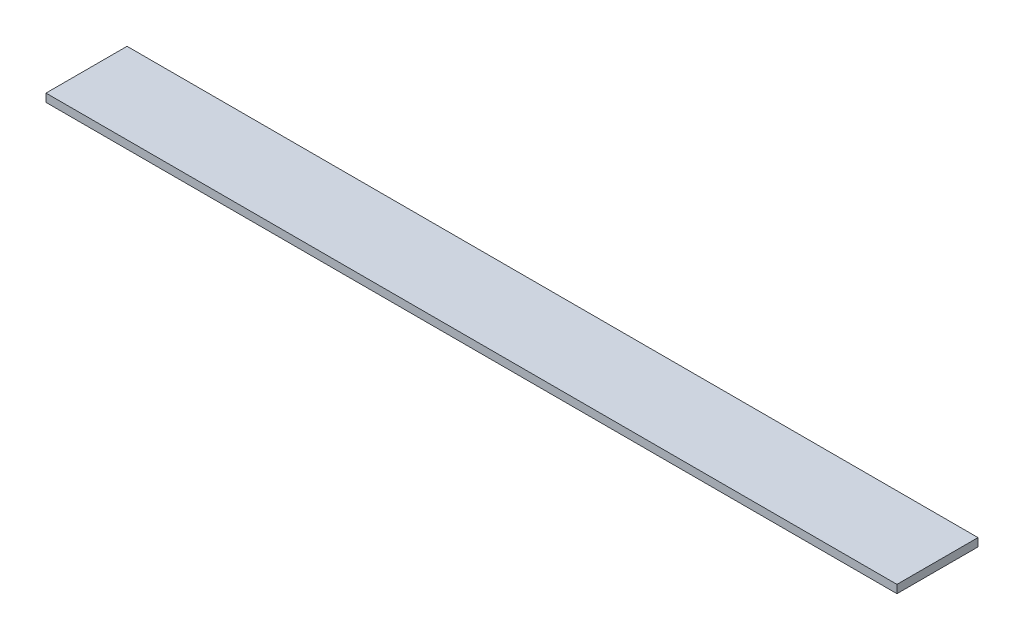
ISO-10303-21;
HEADER;
FILE_DESCRIPTION(('STEP AP214'),'2;1');
FILE_NAME('part.step','',(''),(''),'','','');
FILE_SCHEMA(('AUTOMOTIVE_DESIGN { 1 0 10303 214 1 1 1 1 }'));
ENDSEC;
DATA;
#1=APPLICATION_CONTEXT('core data for automotive mechanical design processes');
#2=APPLICATION_PROTOCOL_DEFINITION('international standard','automotive_design',2000,#1);
#3=PRODUCT_CONTEXT('',#1,'mechanical');
#4=PRODUCT('Part','Part','',(#3));
#5=PRODUCT_RELATED_PRODUCT_CATEGORY('part','',(#4));
#6=PRODUCT_DEFINITION_FORMATION('','',#4);
#7=PRODUCT_DEFINITION_CONTEXT('part definition',#1,'design');
#8=PRODUCT_DEFINITION('design','',#6,#7);
#9=PRODUCT_DEFINITION_SHAPE('','',#8);
#10=(LENGTH_UNIT() NAMED_UNIT(*) SI_UNIT(.MILLI.,.METRE.));
#11=(NAMED_UNIT(*) PLANE_ANGLE_UNIT() SI_UNIT($,.RADIAN.));
#12=(NAMED_UNIT(*) SI_UNIT($,.STERADIAN.) SOLID_ANGLE_UNIT());
#13=UNCERTAINTY_MEASURE_WITH_UNIT(LENGTH_MEASURE(1.E-05),#10,'distance_accuracy_value','');
#14=(GEOMETRIC_REPRESENTATION_CONTEXT(3) GLOBAL_UNCERTAINTY_ASSIGNED_CONTEXT((#13)) GLOBAL_UNIT_ASSIGNED_CONTEXT((#10,
#11,#12)) REPRESENTATION_CONTEXT('',''));
#15=CARTESIAN_POINT('',(0.,0.,0.));
#16=DIRECTION('',(0.,0.,1.));
#17=DIRECTION('',(1.,0.,0.));
#18=AXIS2_PLACEMENT_3D('',#15,#16,#17);
#19=CARTESIAN_POINT('',(0.,10.,0.));
#20=DIRECTION('',(1.,0.,0.));
#21=DIRECTION('',(0.,0.,-1.));
#22=AXIS2_PLACEMENT_3D('',#19,#20,#21);
#23=PLANE('',#22);
#24=DIRECTION('',(0.,0.,1.));
#25=VECTOR('',#24,1.);
#26=CARTESIAN_POINT('',(0.,0.,0.));
#27=LINE('',#26,#25);
#28=CARTESIAN_POINT('',(0.,0.,-100.));
#29=VERTEX_POINT('',#28);
#30=CARTESIAN_POINT('',(0.,0.,0.));
#31=VERTEX_POINT('',#30);
#32=EDGE_CURVE('E94',#29,#31,#27,.T.);
#33=ORIENTED_EDGE('',*,*,#32,.T.);
#34=DIRECTION('',(0.,-1.,0.));
#35=VECTOR('',#34,1.);
#36=CARTESIAN_POINT('',(0.,10.,0.));
#37=LINE('',#36,#35);
#38=CARTESIAN_POINT('',(0.,10.,0.));
#39=VERTEX_POINT('',#38);
#40=EDGE_CURVE('E11',#39,#31,#37,.T.);
#41=ORIENTED_EDGE('',*,*,#40,.F.);
#42=DIRECTION('',(0.,0.,1.));
#43=VECTOR('',#42,1.);
#44=CARTESIAN_POINT('',(0.,10.,0.));
#45=LINE('',#44,#43);
#46=CARTESIAN_POINT('',(0.,10.,-100.));
#47=VERTEX_POINT('',#46);
#48=EDGE_CURVE('E82',#47,#39,#45,.T.);
#49=ORIENTED_EDGE('',*,*,#48,.F.);
#50=DIRECTION('',(0.,-1.,0.));
#51=VECTOR('',#50,1.);
#52=CARTESIAN_POINT('',(0.,10.,-100.));
#53=LINE('',#52,#51);
#54=EDGE_CURVE('E90',#47,#29,#53,.T.);
#55=ORIENTED_EDGE('',*,*,#54,.T.);
#56=EDGE_LOOP('',(#33,#41,#49,#55));
#57=FACE_BOUND('',#56,.T.);
#58=ADVANCED_FACE('F31',(#57),#23,.F.);
#59=CARTESIAN_POINT('',(0.,10.,0.));
#60=DIRECTION('',(0.,0.,-1.));
#61=DIRECTION('',(-1.,0.,0.));
#62=AXIS2_PLACEMENT_3D('',#59,#60,#61);
#63=PLANE('',#62);
#64=DIRECTION('',(1.,0.,0.));
#65=VECTOR('',#64,1.);
#66=CARTESIAN_POINT('',(0.,0.,0.));
#67=LINE('',#66,#65);
#68=CARTESIAN_POINT('',(1050.,0.,0.));
#69=VERTEX_POINT('',#68);
#70=EDGE_CURVE('E86',#31,#69,#67,.T.);
#71=ORIENTED_EDGE('',*,*,#70,.T.);
#72=DIRECTION('',(0.,-1.,0.));
#73=VECTOR('',#72,1.);
#74=CARTESIAN_POINT('',(1050.,10.,0.));
#75=LINE('',#74,#73);
#76=CARTESIAN_POINT('',(1050.,10.,0.));
#77=VERTEX_POINT('',#76);
#78=EDGE_CURVE('E39',#77,#69,#75,.T.);
#79=ORIENTED_EDGE('',*,*,#78,.F.);
#80=DIRECTION('',(1.,0.,0.));
#81=VECTOR('',#80,1.);
#82=CARTESIAN_POINT('',(0.,10.,0.));
#83=LINE('',#82,#81);
#84=EDGE_CURVE('E77',#39,#77,#83,.T.);
#85=ORIENTED_EDGE('',*,*,#84,.F.);
#86=ORIENTED_EDGE('',*,*,#40,.T.);
#87=EDGE_LOOP('',(#71,#79,#85,#86));
#88=FACE_BOUND('',#87,.T.);
#89=ADVANCED_FACE('F85',(#88),#63,.F.);
#90=CARTESIAN_POINT('',(1050.,10.,0.));
#91=DIRECTION('',(-1.,0.,0.));
#92=DIRECTION('',(0.,0.,1.));
#93=AXIS2_PLACEMENT_3D('',#90,#91,#92);
#94=PLANE('',#93);
#95=DIRECTION('',(0.,0.,-1.));
#96=VECTOR('',#95,1.);
#97=CARTESIAN_POINT('',(1050.,0.,0.));
#98=LINE('',#97,#96);
#99=CARTESIAN_POINT('',(1050.,0.,-100.));
#100=VERTEX_POINT('',#99);
#101=EDGE_CURVE('E64',#69,#100,#98,.T.);
#102=ORIENTED_EDGE('',*,*,#101,.T.);
#103=DIRECTION('',(0.,-1.,0.));
#104=VECTOR('',#103,1.);
#105=CARTESIAN_POINT('',(1050.,10.,-100.));
#106=LINE('',#105,#104);
#107=CARTESIAN_POINT('',(1050.,10.,-100.));
#108=VERTEX_POINT('',#107);
#109=EDGE_CURVE('E87',#108,#100,#106,.T.);
#110=ORIENTED_EDGE('',*,*,#109,.F.);
#111=DIRECTION('',(0.,0.,-1.));
#112=VECTOR('',#111,1.);
#113=CARTESIAN_POINT('',(1050.,10.,0.));
#114=LINE('',#113,#112);
#115=EDGE_CURVE('E80',#77,#108,#114,.T.);
#116=ORIENTED_EDGE('',*,*,#115,.F.);
#117=ORIENTED_EDGE('',*,*,#78,.T.);
#118=EDGE_LOOP('',(#102,#110,#116,#117));
#119=FACE_BOUND('',#118,.T.);
#120=ADVANCED_FACE('F88',(#119),#94,.F.);
#121=CARTESIAN_POINT('',(0.,10.,-100.));
#122=DIRECTION('',(0.,0.,1.));
#123=DIRECTION('',(1.,0.,0.));
#124=AXIS2_PLACEMENT_3D('',#121,#122,#123);
#125=PLANE('',#124);
#126=DIRECTION('',(-1.,0.,0.));
#127=VECTOR('',#126,1.);
#128=CARTESIAN_POINT('',(0.,0.,-100.));
#129=LINE('',#128,#127);
#130=EDGE_CURVE('E70',#100,#29,#129,.T.);
#131=ORIENTED_EDGE('',*,*,#130,.T.);
#132=ORIENTED_EDGE('',*,*,#54,.F.);
#133=DIRECTION('',(-1.,0.,0.));
#134=VECTOR('',#133,1.);
#135=CARTESIAN_POINT('',(0.,10.,-100.));
#136=LINE('',#135,#134);
#137=EDGE_CURVE('E47',#108,#47,#136,.T.);
#138=ORIENTED_EDGE('',*,*,#137,.F.);
#139=ORIENTED_EDGE('',*,*,#109,.T.);
#140=EDGE_LOOP('',(#131,#132,#138,#139));
#141=FACE_BOUND('',#140,.T.);
#142=ADVANCED_FACE('F101',(#141),#125,.F.);
#143=CARTESIAN_POINT('',(0.,10.,-100.));
#144=DIRECTION('',(0.,-1.,0.));
#145=DIRECTION('',(0.,0.,-1.));
#146=AXIS2_PLACEMENT_3D('',#143,#144,#145);
#147=PLANE('',#146);
#148=ORIENTED_EDGE('',*,*,#48,.T.);
#149=ORIENTED_EDGE('',*,*,#84,.T.);
#150=ORIENTED_EDGE('',*,*,#115,.T.);
#151=ORIENTED_EDGE('',*,*,#137,.T.);
#152=EDGE_LOOP('',(#148,#149,#150,#151));
#153=FACE_BOUND('',#152,.T.);
#154=ADVANCED_FACE('F78',(#153),#147,.F.);
#155=CARTESIAN_POINT('',(0.,0.,-100.));
#156=DIRECTION('',(0.,-1.,0.));
#157=DIRECTION('',(0.,0.,-1.));
#158=AXIS2_PLACEMENT_3D('',#155,#156,#157);
#159=PLANE('',#158);
#160=ORIENTED_EDGE('',*,*,#32,.F.);
#161=ORIENTED_EDGE('',*,*,#130,.F.);
#162=ORIENTED_EDGE('',*,*,#101,.F.);
#163=ORIENTED_EDGE('',*,*,#70,.F.);
#164=EDGE_LOOP('',(#160,#161,#162,#163));
#165=FACE_BOUND('',#164,.T.);
#166=ADVANCED_FACE('F104',(#165),#159,.T.);
#167=CLOSED_SHELL('',(#58,#89,#120,#142,#154,#166));
#168=MANIFOLD_SOLID_BREP('B2',#167);
#169=ADVANCED_BREP_SHAPE_REPRESENTATION('',(#18,#168),#14);
#170=SHAPE_DEFINITION_REPRESENTATION(#9,#169);
ENDSEC;
END-ISO-10303-21;
